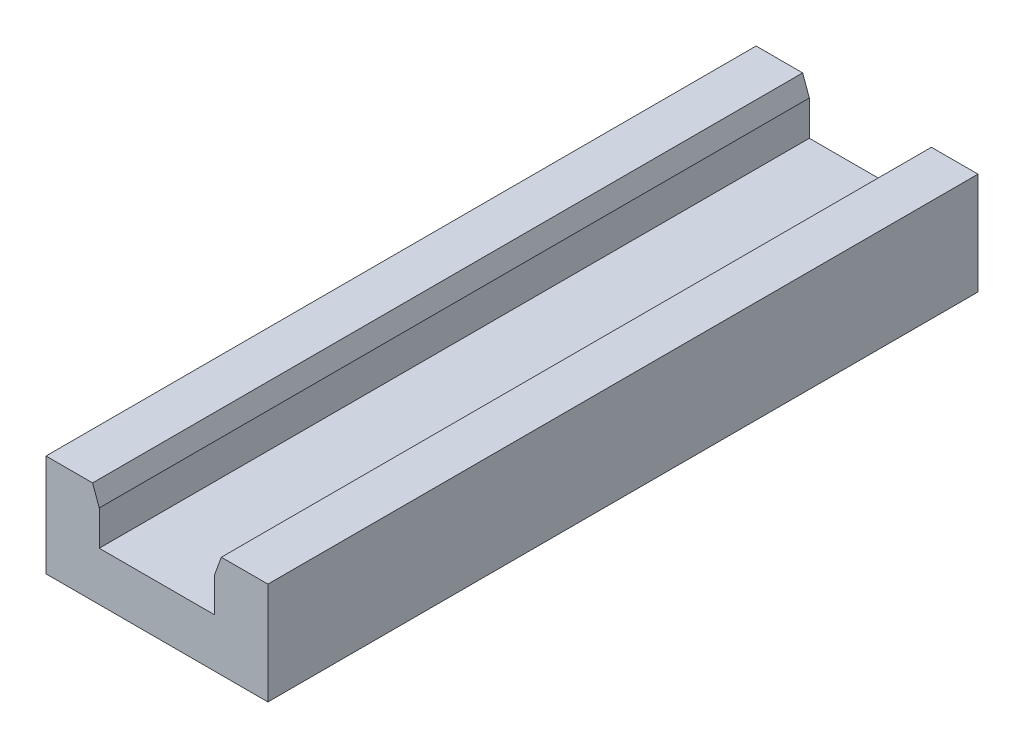
ISO-10303-21;
HEADER;
FILE_DESCRIPTION(('STEP AP214'),'2;1');
FILE_NAME('part.step','',(''),(''),'','','');
FILE_SCHEMA(('AUTOMOTIVE_DESIGN { 1 0 10303 214 1 1 1 1 }'));
ENDSEC;
DATA;
#1=APPLICATION_CONTEXT('core data for automotive mechanical design processes');
#2=APPLICATION_PROTOCOL_DEFINITION('international standard','automotive_design',2000,#1);
#3=PRODUCT_CONTEXT('',#1,'mechanical');
#4=PRODUCT('Part','Part','',(#3));
#5=PRODUCT_RELATED_PRODUCT_CATEGORY('part','',(#4));
#6=PRODUCT_DEFINITION_FORMATION('','',#4);
#7=PRODUCT_DEFINITION_CONTEXT('part definition',#1,'design');
#8=PRODUCT_DEFINITION('design','',#6,#7);
#9=PRODUCT_DEFINITION_SHAPE('','',#8);
#10=(LENGTH_UNIT() NAMED_UNIT(*) SI_UNIT(.MILLI.,.METRE.));
#11=(NAMED_UNIT(*) PLANE_ANGLE_UNIT() SI_UNIT($,.RADIAN.));
#12=(NAMED_UNIT(*) SI_UNIT($,.STERADIAN.) SOLID_ANGLE_UNIT());
#13=UNCERTAINTY_MEASURE_WITH_UNIT(LENGTH_MEASURE(1.E-05),#10,'distance_accuracy_value','');
#14=(GEOMETRIC_REPRESENTATION_CONTEXT(3) GLOBAL_UNCERTAINTY_ASSIGNED_CONTEXT((#13)) GLOBAL_UNIT_ASSIGNED_CONTEXT((#10,
#11,#12)) REPRESENTATION_CONTEXT('',''));
#15=CARTESIAN_POINT('',(0.,0.,0.));
#16=DIRECTION('',(0.,0.,1.));
#17=DIRECTION('',(1.,0.,0.));
#18=AXIS2_PLACEMENT_3D('',#15,#16,#17);
#19=CARTESIAN_POINT('',(38.,19.,160.));
#20=DIRECTION('',(1.,0.,0.));
#21=DIRECTION('',(0.,0.,-1.));
#22=AXIS2_PLACEMENT_3D('',#19,#20,#21);
#23=PLANE('',#22);
#24=DIRECTION('',(0.,-1.,0.));
#25=VECTOR('',#24,1.);
#26=CARTESIAN_POINT('',(38.,19.,0.));
#27=LINE('',#26,#25);
#28=CARTESIAN_POINT('',(38.,26.8601404504638,0.));
#29=VERTEX_POINT('',#28);
#30=CARTESIAN_POINT('',(38.,19.,0.));
#31=VERTEX_POINT('',#30);
#32=EDGE_CURVE('E139',#29,#31,#27,.T.);
#33=ORIENTED_EDGE('',*,*,#32,.T.);
#34=DIRECTION('',(0.,0.,-1.));
#35=VECTOR('',#34,1.);
#36=CARTESIAN_POINT('',(38.,19.,160.));
#37=LINE('',#36,#35);
#38=CARTESIAN_POINT('',(38.,19.,160.));
#39=VERTEX_POINT('',#38);
#40=EDGE_CURVE('E11',#39,#31,#37,.T.);
#41=ORIENTED_EDGE('',*,*,#40,.F.);
#42=DIRECTION('',(0.,-1.,0.));
#43=VECTOR('',#42,1.);
#44=CARTESIAN_POINT('',(38.,19.,160.));
#45=LINE('',#44,#43);
#46=CARTESIAN_POINT('',(38.,26.8601404504638,160.));
#47=VERTEX_POINT('',#46);
#48=EDGE_CURVE('E157',#47,#39,#45,.T.);
#49=ORIENTED_EDGE('',*,*,#48,.F.);
#50=DIRECTION('',(0.,0.,-1.));
#51=VECTOR('',#50,1.);
#52=CARTESIAN_POINT('',(38.,26.8601404504638,160.));
#53=LINE('',#52,#51);
#54=EDGE_CURVE('E135',#47,#29,#53,.T.);
#55=ORIENTED_EDGE('',*,*,#54,.T.);
#56=EDGE_LOOP('',(#33,#41,#49,#55));
#57=FACE_BOUND('',#56,.T.);
#58=ADVANCED_FACE('F31',(#57),#23,.F.);
#59=CARTESIAN_POINT('',(38.,19.,160.));
#60=DIRECTION('',(0.,-1.,0.));
#61=DIRECTION('',(0.,0.,-1.));
#62=AXIS2_PLACEMENT_3D('',#59,#60,#61);
#63=PLANE('',#62);
#64=DIRECTION('',(-1.,0.,0.));
#65=VECTOR('',#64,1.);
#66=CARTESIAN_POINT('',(38.,19.,0.));
#67=LINE('',#66,#65);
#68=CARTESIAN_POINT('',(12.,19.,0.));
#69=VERTEX_POINT('',#68);
#70=EDGE_CURVE('E142',#31,#69,#67,.T.);
#71=ORIENTED_EDGE('',*,*,#70,.T.);
#72=DIRECTION('',(0.,0.,-1.));
#73=VECTOR('',#72,1.);
#74=CARTESIAN_POINT('',(12.,19.,160.));
#75=LINE('',#74,#73);
#76=CARTESIAN_POINT('',(12.,19.,160.));
#77=VERTEX_POINT('',#76);
#78=EDGE_CURVE('E39',#77,#69,#75,.T.);
#79=ORIENTED_EDGE('',*,*,#78,.F.);
#80=DIRECTION('',(-1.,0.,0.));
#81=VECTOR('',#80,1.);
#82=CARTESIAN_POINT('',(38.,19.,160.));
#83=LINE('',#82,#81);
#84=EDGE_CURVE('E96',#39,#77,#83,.T.);
#85=ORIENTED_EDGE('',*,*,#84,.F.);
#86=ORIENTED_EDGE('',*,*,#40,.T.);
#87=EDGE_LOOP('',(#71,#79,#85,#86));
#88=FACE_BOUND('',#87,.T.);
#89=ADVANCED_FACE('F206',(#88),#63,.F.);
#90=CARTESIAN_POINT('',(12.,19.,160.));
#91=DIRECTION('',(-1.,0.,0.));
#92=DIRECTION('',(0.,-1.,0.));
#93=AXIS2_PLACEMENT_3D('',#90,#91,#92);
#94=PLANE('',#93);
#95=DIRECTION('',(0.,1.,0.));
#96=VECTOR('',#95,1.);
#97=CARTESIAN_POINT('',(12.,19.,0.));
#98=LINE('',#97,#96);
#99=CARTESIAN_POINT('',(12.,26.8601404504638,0.));
#100=VERTEX_POINT('',#99);
#101=EDGE_CURVE('E144',#69,#100,#98,.T.);
#102=ORIENTED_EDGE('',*,*,#101,.T.);
#103=DIRECTION('',(0.,0.,-1.));
#104=VECTOR('',#103,1.);
#105=CARTESIAN_POINT('',(12.,26.8601404504638,160.));
#106=LINE('',#105,#104);
#107=CARTESIAN_POINT('',(12.,26.8601404504638,160.));
#108=VERTEX_POINT('',#107);
#109=EDGE_CURVE('E170',#108,#100,#106,.T.);
#110=ORIENTED_EDGE('',*,*,#109,.F.);
#111=DIRECTION('',(0.,1.,0.));
#112=VECTOR('',#111,1.);
#113=CARTESIAN_POINT('',(12.,19.,160.));
#114=LINE('',#113,#112);
#115=EDGE_CURVE('E178',#77,#108,#114,.T.);
#116=ORIENTED_EDGE('',*,*,#115,.F.);
#117=ORIENTED_EDGE('',*,*,#78,.T.);
#118=EDGE_LOOP('',(#102,#110,#116,#117));
#119=FACE_BOUND('',#118,.T.);
#120=ADVANCED_FACE('F176',(#119),#94,.F.);
#121=CARTESIAN_POINT('',(12.,26.8601404504638,160.));
#122=DIRECTION('',(-0.93969262078591,-0.342020143325664,0.));
#123=DIRECTION('',(0.342020143325664,-0.93969262078591,0.));
#124=AXIS2_PLACEMENT_3D('',#121,#122,#123);
#125=PLANE('',#124);
#126=DIRECTION('',(-0.342020143325664,0.93969262078591,0.));
#127=VECTOR('',#126,1.);
#128=CARTESIAN_POINT('',(12.,26.8601404504638,0.));
#129=LINE('',#128,#127);
#130=CARTESIAN_POINT('',(10.4932143499261,31.,0.));
#131=VERTEX_POINT('',#130);
#132=EDGE_CURVE('E146',#100,#131,#129,.T.);
#133=ORIENTED_EDGE('',*,*,#132,.T.);
#134=DIRECTION('',(0.,0.,-1.));
#135=VECTOR('',#134,1.);
#136=CARTESIAN_POINT('',(10.4932143499261,31.,160.));
#137=LINE('',#136,#135);
#138=CARTESIAN_POINT('',(10.4932143499261,31.,160.));
#139=VERTEX_POINT('',#138);
#140=EDGE_CURVE('E167',#139,#131,#137,.T.);
#141=ORIENTED_EDGE('',*,*,#140,.F.);
#142=DIRECTION('',(-0.342020143325664,0.93969262078591,0.));
#143=VECTOR('',#142,1.);
#144=CARTESIAN_POINT('',(12.,26.8601404504638,160.));
#145=LINE('',#144,#143);
#146=EDGE_CURVE('E196',#108,#139,#145,.T.);
#147=ORIENTED_EDGE('',*,*,#146,.F.);
#148=ORIENTED_EDGE('',*,*,#109,.T.);
#149=EDGE_LOOP('',(#133,#141,#147,#148));
#150=FACE_BOUND('',#149,.T.);
#151=ADVANCED_FACE('F187',(#150),#125,.F.);
#152=CARTESIAN_POINT('',(10.4932143499261,31.,160.));
#153=DIRECTION('',(0.,-1.,0.));
#154=DIRECTION('',(0.,0.,-1.));
#155=AXIS2_PLACEMENT_3D('',#152,#153,#154);
#156=PLANE('',#155);
#157=DIRECTION('',(-1.,0.,0.));
#158=VECTOR('',#157,1.);
#159=CARTESIAN_POINT('',(10.4932143499261,31.,0.));
#160=LINE('',#159,#158);
#161=CARTESIAN_POINT('',(0.,31.,0.));
#162=VERTEX_POINT('',#161);
#163=EDGE_CURVE('E148',#131,#162,#160,.T.);
#164=ORIENTED_EDGE('',*,*,#163,.T.);
#165=DIRECTION('',(0.,0.,-1.));
#166=VECTOR('',#165,1.);
#167=CARTESIAN_POINT('',(0.,31.,160.));
#168=LINE('',#167,#166);
#169=CARTESIAN_POINT('',(0.,31.,160.));
#170=VERTEX_POINT('',#169);
#171=EDGE_CURVE('E164',#170,#162,#168,.T.);
#172=ORIENTED_EDGE('',*,*,#171,.F.);
#173=DIRECTION('',(-1.,0.,0.));
#174=VECTOR('',#173,1.);
#175=CARTESIAN_POINT('',(10.4932143499261,31.,160.));
#176=LINE('',#175,#174);
#177=EDGE_CURVE('E193',#139,#170,#176,.T.);
#178=ORIENTED_EDGE('',*,*,#177,.F.);
#179=ORIENTED_EDGE('',*,*,#140,.T.);
#180=EDGE_LOOP('',(#164,#172,#178,#179));
#181=FACE_BOUND('',#180,.T.);
#182=ADVANCED_FACE('F191',(#181),#156,.F.);
#183=CARTESIAN_POINT('',(0.,31.,160.));
#184=DIRECTION('',(1.,0.,0.));
#185=DIRECTION('',(0.,0.,-1.));
#186=AXIS2_PLACEMENT_3D('',#183,#184,#185);
#187=PLANE('',#186);
#188=DIRECTION('',(0.,-1.,0.));
#189=VECTOR('',#188,1.);
#190=CARTESIAN_POINT('',(0.,31.,0.));
#191=LINE('',#190,#189);
#192=CARTESIAN_POINT('',(0.,8.,0.));
#193=VERTEX_POINT('',#192);
#194=EDGE_CURVE('E150',#162,#193,#191,.T.);
#195=ORIENTED_EDGE('',*,*,#194,.T.);
#196=DIRECTION('',(0.,0.,-1.));
#197=VECTOR('',#196,1.);
#198=CARTESIAN_POINT('',(0.,8.,160.));
#199=LINE('',#198,#197);
#200=CARTESIAN_POINT('',(0.,8.,160.));
#201=VERTEX_POINT('',#200);
#202=EDGE_CURVE('E161',#201,#193,#199,.T.);
#203=ORIENTED_EDGE('',*,*,#202,.F.);
#204=DIRECTION('',(0.,-1.,0.));
#205=VECTOR('',#204,1.);
#206=CARTESIAN_POINT('',(0.,31.,160.));
#207=LINE('',#206,#205);
#208=EDGE_CURVE('E195',#170,#201,#207,.T.);
#209=ORIENTED_EDGE('',*,*,#208,.F.);
#210=ORIENTED_EDGE('',*,*,#171,.T.);
#211=EDGE_LOOP('',(#195,#203,#209,#210));
#212=FACE_BOUND('',#211,.T.);
#213=ADVANCED_FACE('F218',(#212),#187,.F.);
#214=CARTESIAN_POINT('',(0.,8.,160.));
#215=DIRECTION('',(0.,1.,0.));
#216=DIRECTION('',(0.,0.,1.));
#217=AXIS2_PLACEMENT_3D('',#214,#215,#216);
#218=PLANE('',#217);
#219=DIRECTION('',(1.,0.,0.));
#220=VECTOR('',#219,1.);
#221=CARTESIAN_POINT('',(0.,8.,0.));
#222=LINE('',#221,#220);
#223=CARTESIAN_POINT('',(50.,8.,0.));
#224=VERTEX_POINT('',#223);
#225=EDGE_CURVE('E152',#193,#224,#222,.T.);
#226=ORIENTED_EDGE('',*,*,#225,.T.);
#227=DIRECTION('',(0.,0.,-1.));
#228=VECTOR('',#227,1.);
#229=CARTESIAN_POINT('',(50.,8.,160.));
#230=LINE('',#229,#228);
#231=CARTESIAN_POINT('',(50.,8.,160.));
#232=VERTEX_POINT('',#231);
#233=EDGE_CURVE('E130',#232,#224,#230,.T.);
#234=ORIENTED_EDGE('',*,*,#233,.F.);
#235=DIRECTION('',(1.,0.,0.));
#236=VECTOR('',#235,1.);
#237=CARTESIAN_POINT('',(0.,8.,160.));
#238=LINE('',#237,#236);
#239=EDGE_CURVE('E121',#201,#232,#238,.T.);
#240=ORIENTED_EDGE('',*,*,#239,.F.);
#241=ORIENTED_EDGE('',*,*,#202,.T.);
#242=EDGE_LOOP('',(#226,#234,#240,#241));
#243=FACE_BOUND('',#242,.T.);
#244=ADVANCED_FACE('F221',(#243),#218,.F.);
#245=CARTESIAN_POINT('',(50.,8.,160.));
#246=DIRECTION('',(-1.,0.,0.));
#247=DIRECTION('',(0.,0.,1.));
#248=AXIS2_PLACEMENT_3D('',#245,#246,#247);
#249=PLANE('',#248);
#250=DIRECTION('',(0.,1.,0.));
#251=VECTOR('',#250,1.);
#252=CARTESIAN_POINT('',(50.,8.,0.));
#253=LINE('',#252,#251);
#254=CARTESIAN_POINT('',(50.,31.,0.));
#255=VERTEX_POINT('',#254);
#256=EDGE_CURVE('E129',#224,#255,#253,.T.);
#257=ORIENTED_EDGE('',*,*,#256,.T.);
#258=DIRECTION('',(0.,0.,-1.));
#259=VECTOR('',#258,1.);
#260=CARTESIAN_POINT('',(50.,31.,160.));
#261=LINE('',#260,#259);
#262=CARTESIAN_POINT('',(50.,31.,160.));
#263=VERTEX_POINT('',#262);
#264=EDGE_CURVE('E126',#263,#255,#261,.T.);
#265=ORIENTED_EDGE('',*,*,#264,.F.);
#266=DIRECTION('',(0.,1.,0.));
#267=VECTOR('',#266,1.);
#268=CARTESIAN_POINT('',(50.,8.,160.));
#269=LINE('',#268,#267);
#270=EDGE_CURVE('E115',#232,#263,#269,.T.);
#271=ORIENTED_EDGE('',*,*,#270,.F.);
#272=ORIENTED_EDGE('',*,*,#233,.T.);
#273=EDGE_LOOP('',(#257,#265,#271,#272));
#274=FACE_BOUND('',#273,.T.);
#275=ADVANCED_FACE('F127',(#274),#249,.F.);
#276=CARTESIAN_POINT('',(39.5067856500739,31.,160.));
#277=DIRECTION('',(0.,-1.,0.));
#278=DIRECTION('',(0.,0.,-1.));
#279=AXIS2_PLACEMENT_3D('',#276,#277,#278);
#280=PLANE('',#279);
#281=DIRECTION('',(-1.,0.,0.));
#282=VECTOR('',#281,1.);
#283=CARTESIAN_POINT('',(39.5067856500739,31.,0.));
#284=LINE('',#283,#282);
#285=CARTESIAN_POINT('',(39.5067856500739,31.,0.));
#286=VERTEX_POINT('',#285);
#287=EDGE_CURVE('E82',#255,#286,#284,.T.);
#288=ORIENTED_EDGE('',*,*,#287,.T.);
#289=DIRECTION('',(0.,0.,-1.));
#290=VECTOR('',#289,1.);
#291=CARTESIAN_POINT('',(39.5067856500739,31.,160.));
#292=LINE('',#291,#290);
#293=CARTESIAN_POINT('',(39.5067856500739,31.,160.));
#294=VERTEX_POINT('',#293);
#295=EDGE_CURVE('E131',#294,#286,#292,.T.);
#296=ORIENTED_EDGE('',*,*,#295,.F.);
#297=DIRECTION('',(-1.,0.,0.));
#298=VECTOR('',#297,1.);
#299=CARTESIAN_POINT('',(39.5067856500739,31.,160.));
#300=LINE('',#299,#298);
#301=EDGE_CURVE('E119',#263,#294,#300,.T.);
#302=ORIENTED_EDGE('',*,*,#301,.F.);
#303=ORIENTED_EDGE('',*,*,#264,.T.);
#304=EDGE_LOOP('',(#288,#296,#302,#303));
#305=FACE_BOUND('',#304,.T.);
#306=ADVANCED_FACE('F133',(#305),#280,.F.);
#307=CARTESIAN_POINT('',(38.,26.8601404504638,160.));
#308=DIRECTION('',(0.939692620785909,-0.342020143325666,0.));
#309=DIRECTION('',(0.342020143325666,0.939692620785909,0.));
#310=AXIS2_PLACEMENT_3D('',#307,#308,#309);
#311=PLANE('',#310);
#312=DIRECTION('',(-0.342020143325666,-0.939692620785909,0.));
#313=VECTOR('',#312,1.);
#314=CARTESIAN_POINT('',(38.,26.8601404504638,0.));
#315=LINE('',#314,#313);
#316=EDGE_CURVE('E88',#286,#29,#315,.T.);
#317=ORIENTED_EDGE('',*,*,#316,.T.);
#318=ORIENTED_EDGE('',*,*,#54,.F.);
#319=DIRECTION('',(-0.342020143325666,-0.939692620785909,0.));
#320=VECTOR('',#319,1.);
#321=CARTESIAN_POINT('',(38.,26.8601404504638,160.));
#322=LINE('',#321,#320);
#323=EDGE_CURVE('E47',#294,#47,#322,.T.);
#324=ORIENTED_EDGE('',*,*,#323,.F.);
#325=ORIENTED_EDGE('',*,*,#295,.T.);
#326=EDGE_LOOP('',(#317,#318,#324,#325));
#327=FACE_BOUND('',#326,.T.);
#328=ADVANCED_FACE('F230',(#327),#311,.F.);
#329=CARTESIAN_POINT('',(38.,31.,160.));
#330=DIRECTION('',(0.,0.,-1.));
#331=DIRECTION('',(-1.,0.,0.));
#332=AXIS2_PLACEMENT_3D('',#329,#330,#331);
#333=PLANE('',#332);
#334=ORIENTED_EDGE('',*,*,#48,.T.);
#335=ORIENTED_EDGE('',*,*,#84,.T.);
#336=ORIENTED_EDGE('',*,*,#115,.T.);
#337=ORIENTED_EDGE('',*,*,#146,.T.);
#338=ORIENTED_EDGE('',*,*,#177,.T.);
#339=ORIENTED_EDGE('',*,*,#208,.T.);
#340=ORIENTED_EDGE('',*,*,#239,.T.);
#341=ORIENTED_EDGE('',*,*,#270,.T.);
#342=ORIENTED_EDGE('',*,*,#301,.T.);
#343=ORIENTED_EDGE('',*,*,#323,.T.);
#344=EDGE_LOOP('',(#334,#335,#336,#337,#338,#339,#340,#341,#342,#343));
#345=FACE_BOUND('',#344,.T.);
#346=ADVANCED_FACE('F117',(#345),#333,.F.);
#347=CARTESIAN_POINT('',(38.,31.,0.));
#348=DIRECTION('',(0.,0.,-1.));
#349=DIRECTION('',(-1.,0.,0.));
#350=AXIS2_PLACEMENT_3D('',#347,#348,#349);
#351=PLANE('',#350);
#352=ORIENTED_EDGE('',*,*,#32,.F.);
#353=ORIENTED_EDGE('',*,*,#316,.F.);
#354=ORIENTED_EDGE('',*,*,#287,.F.);
#355=ORIENTED_EDGE('',*,*,#256,.F.);
#356=ORIENTED_EDGE('',*,*,#225,.F.);
#357=ORIENTED_EDGE('',*,*,#194,.F.);
#358=ORIENTED_EDGE('',*,*,#163,.F.);
#359=ORIENTED_EDGE('',*,*,#132,.F.);
#360=ORIENTED_EDGE('',*,*,#101,.F.);
#361=ORIENTED_EDGE('',*,*,#70,.F.);
#362=EDGE_LOOP('',(#352,#353,#354,#355,#356,#357,#358,#359,#360,#361));
#363=FACE_BOUND('',#362,.T.);
#364=ADVANCED_FACE('F182',(#363),#351,.T.);
#365=CLOSED_SHELL('',(#58,#89,#120,#151,#182,#213,#244,#275,#306,#328,#346,#364));
#366=MANIFOLD_SOLID_BREP('B2',#365);
#367=ADVANCED_BREP_SHAPE_REPRESENTATION('',(#18,#366),#14);
#368=SHAPE_DEFINITION_REPRESENTATION(#9,#367);
ENDSEC;
END-ISO-10303-21;
